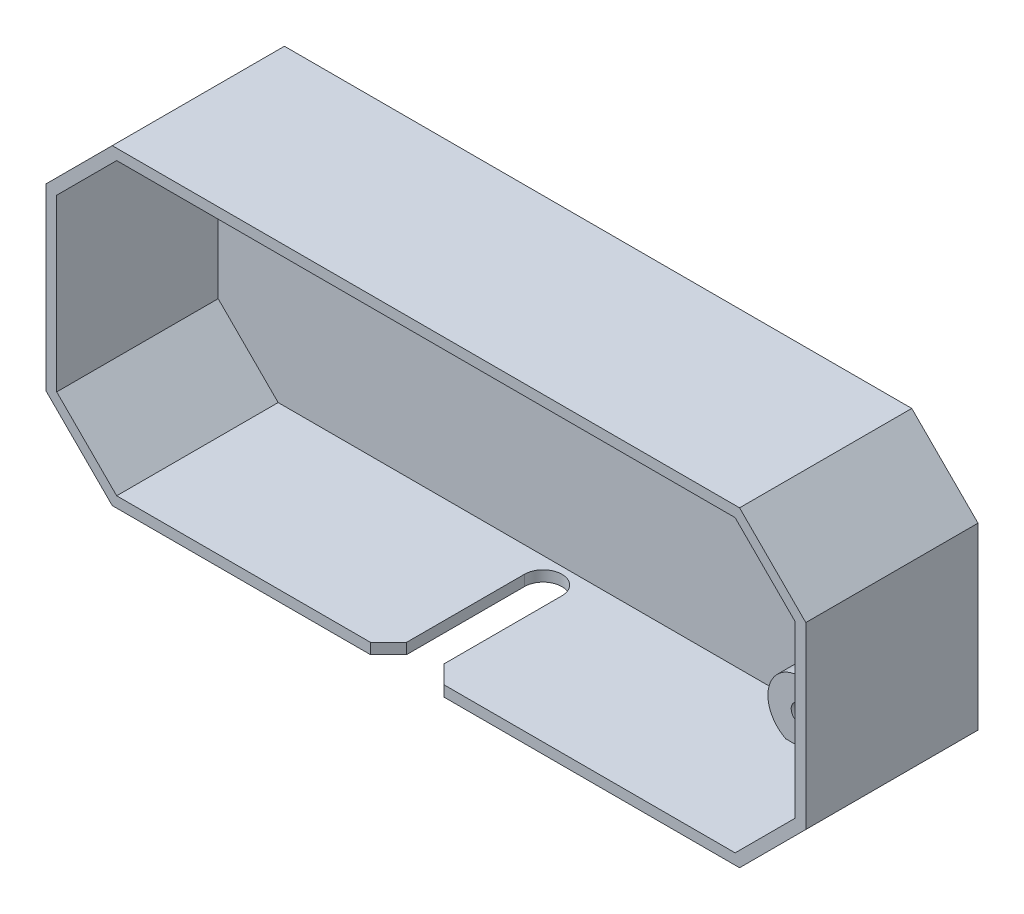
ISO-10303-21;
HEADER;
FILE_DESCRIPTION(('STEP AP214'),'2;1');
FILE_NAME('part.step','',(''),(''),'','','');
FILE_SCHEMA(('AUTOMOTIVE_DESIGN { 1 0 10303 214 1 1 1 1 }'));
ENDSEC;
DATA;
#1=APPLICATION_CONTEXT('core data for automotive mechanical design processes');
#2=APPLICATION_PROTOCOL_DEFINITION('international standard','automotive_design',2000,#1);
#3=PRODUCT_CONTEXT('',#1,'mechanical');
#4=PRODUCT('Part','Part','',(#3));
#5=PRODUCT_RELATED_PRODUCT_CATEGORY('part','',(#4));
#6=PRODUCT_DEFINITION_FORMATION('','',#4);
#7=PRODUCT_DEFINITION_CONTEXT('part definition',#1,'design');
#8=PRODUCT_DEFINITION('design','',#6,#7);
#9=PRODUCT_DEFINITION_SHAPE('','',#8);
#10=(LENGTH_UNIT() NAMED_UNIT(*) SI_UNIT(.MILLI.,.METRE.));
#11=(NAMED_UNIT(*) PLANE_ANGLE_UNIT() SI_UNIT($,.RADIAN.));
#12=(NAMED_UNIT(*) SI_UNIT($,.STERADIAN.) SOLID_ANGLE_UNIT());
#13=UNCERTAINTY_MEASURE_WITH_UNIT(LENGTH_MEASURE(1.E-05),#10,'distance_accuracy_value','');
#14=(GEOMETRIC_REPRESENTATION_CONTEXT(3) GLOBAL_UNCERTAINTY_ASSIGNED_CONTEXT((#13)) GLOBAL_UNIT_ASSIGNED_CONTEXT((#10,
#11,#12)) REPRESENTATION_CONTEXT('',''));
#15=CARTESIAN_POINT('',(0.,0.,0.));
#16=DIRECTION('',(0.,0.,1.));
#17=DIRECTION('',(1.,0.,0.));
#18=AXIS2_PLACEMENT_3D('',#15,#16,#17);
#19=CARTESIAN_POINT('',(0.,0.,0.8));
#20=DIRECTION('',(0.,0.,-1.));
#21=DIRECTION('',(-1.,0.,0.));
#22=AXIS2_PLACEMENT_3D('',#19,#20,#21);
#23=PLANE('',#22);
#24=CARTESIAN_POINT('',(18.694400051,-8.686800051,0.8));
#25=DIRECTION('',(0.,0.,1.));
#26=DIRECTION('',(1.,0.,0.));
#27=AXIS2_PLACEMENT_3D('',#24,#25,#26);
#28=CIRCLE('',#27,2.413);
#29=CARTESIAN_POINT('',(19.7720307855283,-10.845800051,0.8));
#30=VERTEX_POINT('',#29);
#31=CARTESIAN_POINT('',(17.6167693164717,-10.845800051,0.8));
#32=VERTEX_POINT('',#31);
#33=EDGE_CURVE('E285',#30,#32,#28,.T.);
#34=ORIENTED_EDGE('',*,*,#33,.F.);
#35=DIRECTION('',(1.,0.,0.));
#36=VECTOR('',#35,1.);
#37=CARTESIAN_POINT('',(-23.1032817327957,-10.845800051,0.8));
#38=LINE('',#37,#36);
#39=CARTESIAN_POINT('',(23.1032817327957,-10.845800051,0.8));
#40=VERTEX_POINT('',#39);
#41=EDGE_CURVE('E342',#30,#40,#38,.T.);
#42=ORIENTED_EDGE('',*,*,#41,.T.);
#43=DIRECTION('',(0.707106781186544,0.707106781186551,0.));
#44=VECTOR('',#43,1.);
#45=CARTESIAN_POINT('',(23.1032817327957,-10.845800051,0.8));
#46=LINE('',#45,#44);
#47=CARTESIAN_POINT('',(27.584400051,-6.36468173279567,0.8));
#48=VERTEX_POINT('',#47);
#49=EDGE_CURVE('E346',#40,#48,#46,.T.);
#50=ORIENTED_EDGE('',*,*,#49,.T.);
#51=DIRECTION('',(0.,1.,0.));
#52=VECTOR('',#51,1.);
#53=CARTESIAN_POINT('',(27.584400051,-6.36468173279567,0.8));
#54=LINE('',#53,#52);
#55=CARTESIAN_POINT('',(27.584400051,6.36468173279571,0.8));
#56=VERTEX_POINT('',#55);
#57=EDGE_CURVE('E349',#48,#56,#54,.T.);
#58=ORIENTED_EDGE('',*,*,#57,.T.);
#59=DIRECTION('',(-0.707106781186551,0.707106781186544,0.));
#60=VECTOR('',#59,1.);
#61=CARTESIAN_POINT('',(27.584400051,6.36468173279571,0.8));
#62=LINE('',#61,#60);
#63=CARTESIAN_POINT('',(23.1032817327957,10.845800051,0.8));
#64=VERTEX_POINT('',#63);
#65=EDGE_CURVE('E312',#56,#64,#62,.T.);
#66=ORIENTED_EDGE('',*,*,#65,.T.);
#67=DIRECTION('',(-1.,0.,0.));
#68=VECTOR('',#67,1.);
#69=CARTESIAN_POINT('',(23.1032817327957,10.845800051,0.8));
#70=LINE('',#69,#68);
#71=CARTESIAN_POINT('',(-20.4410373037231,10.845800051,0.8));
#72=VERTEX_POINT('',#71);
#73=EDGE_CURVE('E330',#64,#72,#70,.T.);
#74=ORIENTED_EDGE('',*,*,#73,.T.);
#75=CARTESIAN_POINT('',(-21.742400051,8.813800051,0.8));
#76=DIRECTION('',(0.,0.,-1.));
#77=DIRECTION('',(-1.,0.,0.));
#78=AXIS2_PLACEMENT_3D('',#75,#76,#77);
#79=CIRCLE('',#78,2.413);
#80=CARTESIAN_POINT('',(-23.6215236040898,10.3275581797058,0.8));
#81=VERTEX_POINT('',#80);
#82=EDGE_CURVE('E437',#81,#72,#79,.F.);
#83=ORIENTED_EDGE('',*,*,#82,.F.);
#84=DIRECTION('',(-0.707106781186551,-0.707106781186544,0.));
#85=VECTOR('',#84,1.);
#86=CARTESIAN_POINT('',(-23.1032817327957,10.845800051,0.8));
#87=LINE('',#86,#85);
#88=CARTESIAN_POINT('',(-27.584400051,6.36468173279571,0.8));
#89=VERTEX_POINT('',#88);
#90=EDGE_CURVE('E332',#81,#89,#87,.T.);
#91=ORIENTED_EDGE('',*,*,#90,.T.);
#92=DIRECTION('',(0.,-1.,0.));
#93=VECTOR('',#92,1.);
#94=CARTESIAN_POINT('',(-27.584400051,6.36468173279571,0.8));
#95=LINE('',#94,#93);
#96=CARTESIAN_POINT('',(-27.584400051,-6.36468173279567,0.8));
#97=VERTEX_POINT('',#96);
#98=EDGE_CURVE('E336',#89,#97,#95,.T.);
#99=ORIENTED_EDGE('',*,*,#98,.T.);
#100=DIRECTION('',(0.707106781186544,-0.707106781186551,0.));
#101=VECTOR('',#100,1.);
#102=CARTESIAN_POINT('',(-27.584400051,-6.36468173279567,0.8));
#103=LINE('',#102,#101);
#104=CARTESIAN_POINT('',(-23.1032817327957,-10.845800051,0.8));
#105=VERTEX_POINT('',#104);
#106=EDGE_CURVE('E339',#97,#105,#103,.T.);
#107=ORIENTED_EDGE('',*,*,#106,.T.);
#108=EDGE_CURVE('E343',#105,#32,#38,.T.);
#109=ORIENTED_EDGE('',*,*,#108,.T.);
#110=EDGE_LOOP('',(#34,#42,#50,#58,#66,#74,#83,#91,#99,#107,#109));
#111=FACE_BOUND('',#110,.T.);
#112=ADVANCED_FACE('F41',(#111),#23,.F.);
#113=CARTESIAN_POINT('',(-23.1032817327957,-10.845800051,12.865));
#114=DIRECTION('',(0.,1.,0.));
#115=DIRECTION('',(0.,0.,1.));
#116=AXIS2_PLACEMENT_3D('',#113,#114,#115);
#117=PLANE('',#116);
#118=DIRECTION('',(-0.707106781186551,0.,0.707106781186544));
#119=VECTOR('',#118,1.);
#120=CARTESIAN_POINT('',(-13.6221600754781,-10.845800051,22.3461216573177));
#121=LINE('',#120,#119);
#122=CARTESIAN_POINT('',(-2.794,-10.845800051,11.5179615818396));
#123=VERTEX_POINT('',#122);
#124=CARTESIAN_POINT('',(-4.14103841816038,-10.845800051,12.865));
#125=VERTEX_POINT('',#124);
#126=EDGE_CURVE('E266',#123,#125,#121,.T.);
#127=ORIENTED_EDGE('',*,*,#126,.F.);
#128=DIRECTION('',(0.,0.,1.));
#129=VECTOR('',#128,1.);
#130=CARTESIAN_POINT('',(-2.79400000000001,-10.845800051,12.8650000000001));
#131=LINE('',#130,#129);
#132=CARTESIAN_POINT('',(-2.79399999999994,-10.845800051,2.705));
#133=VERTEX_POINT('',#132);
#134=EDGE_CURVE('E269',#133,#123,#131,.T.);
#135=ORIENTED_EDGE('',*,*,#134,.F.);
#136=CARTESIAN_POINT('',(-1.39699999999994,-10.845800051,2.705));
#137=DIRECTION('',(0.,1.,0.));
#138=DIRECTION('',(0.,0.,1.));
#139=AXIS2_PLACEMENT_3D('',#136,#137,#138);
#140=CIRCLE('',#139,1.397);
#141=CARTESIAN_POINT('',(0.,-10.845800051,2.705));
#142=VERTEX_POINT('',#141);
#143=EDGE_CURVE('E271',#142,#133,#140,.T.);
#144=ORIENTED_EDGE('',*,*,#143,.F.);
#145=DIRECTION('',(0.,0.,-1.));
#146=VECTOR('',#145,1.);
#147=CARTESIAN_POINT('',(1.28369537222284E-13,-10.845800051,12.8649999999998));
#148=LINE('',#147,#146);
#149=CARTESIAN_POINT('',(1.19465925829897E-13,-10.845800051,11.5179615818395));
#150=VERTEX_POINT('',#149);
#151=EDGE_CURVE('E234',#150,#142,#148,.T.);
#152=ORIENTED_EDGE('',*,*,#151,.F.);
#153=DIRECTION('',(-0.707106781186489,0.,-0.707106781186606));
#154=VECTOR('',#153,1.);
#155=CARTESIAN_POINT('',(-10.8781216573156,-10.845800051,0.639839924521955));
#156=LINE('',#155,#154);
#157=CARTESIAN_POINT('',(1.34703841816038,-10.845800051,12.865));
#158=VERTEX_POINT('',#157);
#159=EDGE_CURVE('E260',#158,#150,#156,.T.);
#160=ORIENTED_EDGE('',*,*,#159,.F.);
#161=DIRECTION('',(1.,0.,0.));
#162=VECTOR('',#161,1.);
#163=CARTESIAN_POINT('',(-23.1032817327957,-10.845800051,12.865));
#164=LINE('',#163,#162);
#165=CARTESIAN_POINT('',(23.1032817327957,-10.845800051,12.865));
#166=VERTEX_POINT('',#165);
#167=EDGE_CURVE('E318',#158,#166,#164,.T.);
#168=ORIENTED_EDGE('',*,*,#167,.T.);
#169=DIRECTION('',(0.,0.,-1.));
#170=VECTOR('',#169,1.);
#171=CARTESIAN_POINT('',(23.1032817327957,-10.845800051,12.865));
#172=LINE('',#171,#170);
#173=EDGE_CURVE('E359',#166,#40,#172,.T.);
#174=ORIENTED_EDGE('',*,*,#173,.T.);
#175=ORIENTED_EDGE('',*,*,#41,.F.);
#176=DIRECTION('',(0.,0.,-1.));
#177=VECTOR('',#176,1.);
#178=CARTESIAN_POINT('',(19.7720307855283,-10.845800051,3.594));
#179=LINE('',#178,#177);
#180=CARTESIAN_POINT('',(19.7720307855283,-10.845800051,3.594));
#181=VERTEX_POINT('',#180);
#182=EDGE_CURVE('E447',#30,#181,#179,.F.);
#183=ORIENTED_EDGE('',*,*,#182,.T.);
#184=DIRECTION('',(1.,0.,0.));
#185=VECTOR('',#184,1.);
#186=CARTESIAN_POINT('',(-23.1032817327957,-10.845800051,3.594));
#187=LINE('',#186,#185);
#188=CARTESIAN_POINT('',(17.6167693164717,-10.845800051,3.594));
#189=VERTEX_POINT('',#188);
#190=EDGE_CURVE('E66',#189,#181,#187,.T.);
#191=ORIENTED_EDGE('',*,*,#190,.F.);
#192=DIRECTION('',(0.,0.,-1.));
#193=VECTOR('',#192,1.);
#194=CARTESIAN_POINT('',(17.6167693164717,-10.845800051,3.594));
#195=LINE('',#194,#193);
#196=EDGE_CURVE('E445',#189,#32,#195,.T.);
#197=ORIENTED_EDGE('',*,*,#196,.T.);
#198=ORIENTED_EDGE('',*,*,#108,.F.);
#199=DIRECTION('',(0.,0.,-1.));
#200=VECTOR('',#199,1.);
#201=CARTESIAN_POINT('',(-23.1032817327957,-10.845800051,12.865));
#202=LINE('',#201,#200);
#203=CARTESIAN_POINT('',(-23.1032817327957,-10.845800051,12.865));
#204=VERTEX_POINT('',#203);
#205=EDGE_CURVE('E362',#204,#105,#202,.T.);
#206=ORIENTED_EDGE('',*,*,#205,.F.);
#207=EDGE_CURVE('E319',#204,#125,#164,.T.);
#208=ORIENTED_EDGE('',*,*,#207,.T.);
#209=EDGE_LOOP('',(#127,#135,#144,#152,#160,#168,#174,#175,#183,#191,#197,#198,#206,#208));
#210=FACE_BOUND('',#209,.T.);
#211=ADVANCED_FACE('F455',(#210),#117,.T.);
#212=CARTESIAN_POINT('',(23.1032817327957,10.845800051,12.865));
#213=DIRECTION('',(0.,-1.,0.));
#214=DIRECTION('',(0.,0.,-1.));
#215=AXIS2_PLACEMENT_3D('',#212,#213,#214);
#216=PLANE('',#215);
#217=CARTESIAN_POINT('',(-23.0437627982769,10.845800051,0.8));
#218=VERTEX_POINT('',#217);
#219=CARTESIAN_POINT('',(-23.1032817327957,10.845800051,0.8));
#220=VERTEX_POINT('',#219);
#221=EDGE_CURVE('E307',#218,#220,#70,.T.);
#222=ORIENTED_EDGE('',*,*,#221,.F.);
#223=DIRECTION('',(0.,0.,-1.));
#224=VECTOR('',#223,1.);
#225=CARTESIAN_POINT('',(-23.0437627982769,10.845800051,3.594));
#226=LINE('',#225,#224);
#227=CARTESIAN_POINT('',(-23.0437627982769,10.845800051,3.594));
#228=VERTEX_POINT('',#227);
#229=EDGE_CURVE('E302',#218,#228,#226,.F.);
#230=ORIENTED_EDGE('',*,*,#229,.T.);
#231=DIRECTION('',(-1.,0.,0.));
#232=VECTOR('',#231,1.);
#233=CARTESIAN_POINT('',(23.1032817327957,10.845800051,3.594));
#234=LINE('',#233,#232);
#235=CARTESIAN_POINT('',(-20.4410373037231,10.845800051,3.594));
#236=VERTEX_POINT('',#235);
#237=EDGE_CURVE('E304',#236,#228,#234,.T.);
#238=ORIENTED_EDGE('',*,*,#237,.F.);
#239=DIRECTION('',(0.,0.,-1.));
#240=VECTOR('',#239,1.);
#241=CARTESIAN_POINT('',(-20.4410373037231,10.845800051,3.594));
#242=LINE('',#241,#240);
#243=EDGE_CURVE('E299',#236,#72,#242,.T.);
#244=ORIENTED_EDGE('',*,*,#243,.T.);
#245=ORIENTED_EDGE('',*,*,#73,.F.);
#246=DIRECTION('',(0.,0.,-1.));
#247=VECTOR('',#246,1.);
#248=CARTESIAN_POINT('',(23.1032817327957,10.845800051,12.865));
#249=LINE('',#248,#247);
#250=CARTESIAN_POINT('',(23.1032817327957,10.845800051,12.865));
#251=VERTEX_POINT('',#250);
#252=EDGE_CURVE('E329',#251,#64,#249,.T.);
#253=ORIENTED_EDGE('',*,*,#252,.F.);
#254=DIRECTION('',(-1.,0.,0.));
#255=VECTOR('',#254,1.);
#256=CARTESIAN_POINT('',(23.1032817327957,10.845800051,12.865));
#257=LINE('',#256,#255);
#258=CARTESIAN_POINT('',(-23.1032817327957,10.845800051,12.865));
#259=VERTEX_POINT('',#258);
#260=EDGE_CURVE('E308',#251,#259,#257,.T.);
#261=ORIENTED_EDGE('',*,*,#260,.T.);
#262=DIRECTION('',(0.,0.,-1.));
#263=VECTOR('',#262,1.);
#264=CARTESIAN_POINT('',(-23.1032817327957,10.845800051,12.865));
#265=LINE('',#264,#263);
#266=EDGE_CURVE('E369',#259,#220,#265,.T.);
#267=ORIENTED_EDGE('',*,*,#266,.T.);
#268=EDGE_LOOP('',(#222,#230,#238,#244,#245,#253,#261,#267));
#269=FACE_BOUND('',#268,.T.);
#270=ADVANCED_FACE('F499',(#269),#216,.T.);
#271=CARTESIAN_POINT('',(-23.1032817327957,10.845800051,12.865));
#272=DIRECTION('',(0.707106781186544,-0.707106781186551,0.));
#273=DIRECTION('',(0.707106781186551,0.707106781186544,0.));
#274=AXIS2_PLACEMENT_3D('',#271,#272,#273);
#275=PLANE('',#274);
#276=ORIENTED_EDGE('',*,*,#90,.F.);
#277=DIRECTION('',(0.,0.,-1.));
#278=VECTOR('',#277,1.);
#279=CARTESIAN_POINT('',(-23.6215236040898,10.3275581797058,3.594));
#280=LINE('',#279,#278);
#281=CARTESIAN_POINT('',(-23.6215236040898,10.3275581797058,3.594));
#282=VERTEX_POINT('',#281);
#283=EDGE_CURVE('E297',#81,#282,#280,.F.);
#284=ORIENTED_EDGE('',*,*,#283,.T.);
#285=DIRECTION('',(-0.707106781186551,-0.707106781186544,0.));
#286=VECTOR('',#285,1.);
#287=CARTESIAN_POINT('',(-23.1032817327957,10.845800051,3.594));
#288=LINE('',#287,#286);
#289=CARTESIAN_POINT('',(-23.2561581797058,10.6929236040899,3.594));
#290=VERTEX_POINT('',#289);
#291=EDGE_CURVE('E441',#290,#282,#288,.T.);
#292=ORIENTED_EDGE('',*,*,#291,.F.);
#293=DIRECTION('',(0.,0.,-1.));
#294=VECTOR('',#293,1.);
#295=CARTESIAN_POINT('',(-23.2561581797058,10.6929236040899,3.594));
#296=LINE('',#295,#294);
#297=CARTESIAN_POINT('',(-23.2561581797058,10.6929236040899,0.8));
#298=VERTEX_POINT('',#297);
#299=EDGE_CURVE('E295',#290,#298,#296,.T.);
#300=ORIENTED_EDGE('',*,*,#299,.T.);
#301=EDGE_CURVE('E333',#220,#298,#87,.T.);
#302=ORIENTED_EDGE('',*,*,#301,.F.);
#303=ORIENTED_EDGE('',*,*,#266,.F.);
#304=DIRECTION('',(-0.707106781186551,-0.707106781186544,0.));
#305=VECTOR('',#304,1.);
#306=CARTESIAN_POINT('',(-23.1032817327957,10.845800051,12.865));
#307=LINE('',#306,#305);
#308=CARTESIAN_POINT('',(-27.584400051,6.36468173279571,12.865));
#309=VERTEX_POINT('',#308);
#310=EDGE_CURVE('E311',#259,#309,#307,.T.);
#311=ORIENTED_EDGE('',*,*,#310,.T.);
#312=DIRECTION('',(0.,0.,-1.));
#313=VECTOR('',#312,1.);
#314=CARTESIAN_POINT('',(-27.584400051,6.36468173279571,12.865));
#315=LINE('',#314,#313);
#316=EDGE_CURVE('E366',#309,#89,#315,.T.);
#317=ORIENTED_EDGE('',*,*,#316,.T.);
#318=EDGE_LOOP('',(#276,#284,#292,#300,#302,#303,#311,#317));
#319=FACE_BOUND('',#318,.T.);
#320=ADVANCED_FACE('F504',(#319),#275,.T.);
#321=EDGE_CURVE('E440',#218,#298,#79,.F.);
#322=ORIENTED_EDGE('',*,*,#321,.F.);
#323=ORIENTED_EDGE('',*,*,#221,.T.);
#324=ORIENTED_EDGE('',*,*,#301,.T.);
#325=EDGE_LOOP('',(#322,#323,#324));
#326=FACE_BOUND('',#325,.T.);
#327=ADVANCED_FACE('F495',(#326),#23,.F.);
#328=CARTESIAN_POINT('',(28.384400051,-11.645800051,0.8));
#329=DIRECTION('',(-1.,0.,0.));
#330=DIRECTION('',(0.,0.,1.));
#331=AXIS2_PLACEMENT_3D('',#328,#329,#330);
#332=PLANE('',#331);
#333=DIRECTION('',(0.,1.,0.));
#334=VECTOR('',#333,1.);
#335=CARTESIAN_POINT('',(28.384400051,-11.645800051,0.));
#336=LINE('',#335,#334);
#337=CARTESIAN_POINT('',(28.384400051,-6.69605258269414,0.));
#338=VERTEX_POINT('',#337);
#339=CARTESIAN_POINT('',(28.384400051,6.69605258269418,0.));
#340=VERTEX_POINT('',#339);
#341=EDGE_CURVE('E426',#338,#340,#336,.T.);
#342=ORIENTED_EDGE('',*,*,#341,.T.);
#343=DIRECTION('',(0.,0.,1.));
#344=VECTOR('',#343,1.);
#345=CARTESIAN_POINT('',(28.384400051,6.69605258269419,0.));
#346=LINE('',#345,#344);
#347=CARTESIAN_POINT('',(28.384400051,6.69605258269419,12.865));
#348=VERTEX_POINT('',#347);
#349=EDGE_CURVE('E402',#340,#348,#346,.T.);
#350=ORIENTED_EDGE('',*,*,#349,.T.);
#351=DIRECTION('',(0.,1.,0.));
#352=VECTOR('',#351,1.);
#353=CARTESIAN_POINT('',(28.384400051,-6.69605258269414,12.865));
#354=LINE('',#353,#352);
#355=CARTESIAN_POINT('',(28.384400051,-6.69605258269414,12.865));
#356=VERTEX_POINT('',#355);
#357=EDGE_CURVE('E395',#356,#348,#354,.T.);
#358=ORIENTED_EDGE('',*,*,#357,.F.);
#359=DIRECTION('',(0.,0.,1.));
#360=VECTOR('',#359,1.);
#361=CARTESIAN_POINT('',(28.384400051,-6.69605258269414,0.));
#362=LINE('',#361,#360);
#363=EDGE_CURVE('E408',#338,#356,#362,.T.);
#364=ORIENTED_EDGE('',*,*,#363,.F.);
#365=EDGE_LOOP('',(#342,#350,#358,#364));
#366=FACE_BOUND('',#365,.T.);
#367=ADVANCED_FACE('F43',(#366),#332,.F.);
#368=CARTESIAN_POINT('',(-28.384400051,11.645800051,0.8));
#369=DIRECTION('',(0.,-1.,0.));
#370=DIRECTION('',(0.,0.,-1.));
#371=AXIS2_PLACEMENT_3D('',#368,#369,#370);
#372=PLANE('',#371);
#373=DIRECTION('',(0.,0.,1.));
#374=VECTOR('',#373,1.);
#375=CARTESIAN_POINT('',(-23.4346525826941,11.645800051,0.));
#376=LINE('',#375,#374);
#377=CARTESIAN_POINT('',(-23.4346525826941,11.645800051,0.));
#378=VERTEX_POINT('',#377);
#379=CARTESIAN_POINT('',(-23.4346525826941,11.645800051,12.865));
#380=VERTEX_POINT('',#379);
#381=EDGE_CURVE('E417',#378,#380,#376,.T.);
#382=ORIENTED_EDGE('',*,*,#381,.T.);
#383=DIRECTION('',(-1.,0.,0.));
#384=VECTOR('',#383,1.);
#385=CARTESIAN_POINT('',(23.4346525826941,11.645800051,12.865));
#386=LINE('',#385,#384);
#387=CARTESIAN_POINT('',(23.4346525826941,11.645800051,12.865));
#388=VERTEX_POINT('',#387);
#389=EDGE_CURVE('E375',#388,#380,#386,.T.);
#390=ORIENTED_EDGE('',*,*,#389,.F.);
#391=DIRECTION('',(0.,0.,1.));
#392=VECTOR('',#391,1.);
#393=CARTESIAN_POINT('',(23.4346525826941,11.645800051,0.));
#394=LINE('',#393,#392);
#395=CARTESIAN_POINT('',(23.4346525826941,11.645800051,0.));
#396=VERTEX_POINT('',#395);
#397=EDGE_CURVE('E401',#396,#388,#394,.T.);
#398=ORIENTED_EDGE('',*,*,#397,.F.);
#399=DIRECTION('',(-1.,0.,0.));
#400=VECTOR('',#399,1.);
#401=CARTESIAN_POINT('',(-28.384400051,11.645800051,0.));
#402=LINE('',#401,#400);
#403=EDGE_CURVE('E430',#396,#378,#402,.T.);
#404=ORIENTED_EDGE('',*,*,#403,.T.);
#405=EDGE_LOOP('',(#382,#390,#398,#404));
#406=FACE_BOUND('',#405,.T.);
#407=ADVANCED_FACE('F510',(#406),#372,.F.);
#408=CARTESIAN_POINT('',(-28.384400051,-11.645800051,0.8));
#409=DIRECTION('',(1.,0.,0.));
#410=DIRECTION('',(0.,0.,-1.));
#411=AXIS2_PLACEMENT_3D('',#408,#409,#410);
#412=PLANE('',#411);
#413=DIRECTION('',(0.,0.,1.));
#414=VECTOR('',#413,1.);
#415=CARTESIAN_POINT('',(-28.384400051,-6.69605258269414,0.));
#416=LINE('',#415,#414);
#417=CARTESIAN_POINT('',(-28.384400051,-6.69605258269414,0.));
#418=VERTEX_POINT('',#417);
#419=CARTESIAN_POINT('',(-28.384400051,-6.69605258269415,12.865));
#420=VERTEX_POINT('',#419);
#421=EDGE_CURVE('E424',#418,#420,#416,.T.);
#422=ORIENTED_EDGE('',*,*,#421,.T.);
#423=DIRECTION('',(0.,-1.,0.));
#424=VECTOR('',#423,1.);
#425=CARTESIAN_POINT('',(-28.384400051,6.69605258269419,12.865));
#426=LINE('',#425,#424);
#427=CARTESIAN_POINT('',(-28.384400051,6.69605258269419,12.865));
#428=VERTEX_POINT('',#427);
#429=EDGE_CURVE('E382',#428,#420,#426,.T.);
#430=ORIENTED_EDGE('',*,*,#429,.F.);
#431=DIRECTION('',(0.,0.,1.));
#432=VECTOR('',#431,1.);
#433=CARTESIAN_POINT('',(-28.384400051,6.69605258269419,0.));
#434=LINE('',#433,#432);
#435=CARTESIAN_POINT('',(-28.384400051,6.69605258269419,0.));
#436=VERTEX_POINT('',#435);
#437=EDGE_CURVE('E416',#436,#428,#434,.T.);
#438=ORIENTED_EDGE('',*,*,#437,.F.);
#439=DIRECTION('',(0.,-1.,0.));
#440=VECTOR('',#439,1.);
#441=CARTESIAN_POINT('',(-28.384400051,-11.645800051,0.));
#442=LINE('',#441,#440);
#443=EDGE_CURVE('E432',#436,#418,#442,.T.);
#444=ORIENTED_EDGE('',*,*,#443,.T.);
#445=EDGE_LOOP('',(#422,#430,#438,#444));
#446=FACE_BOUND('',#445,.T.);
#447=ADVANCED_FACE('F634',(#446),#412,.F.);
#448=CARTESIAN_POINT('',(-28.384400051,-11.645800051,0.8));
#449=DIRECTION('',(0.,1.,0.));
#450=DIRECTION('',(0.,0.,1.));
#451=AXIS2_PLACEMENT_3D('',#448,#449,#450);
#452=PLANE('',#451);
#453=DIRECTION('',(0.,0.,-1.));
#454=VECTOR('',#453,1.);
#455=CARTESIAN_POINT('',(-2.79399999999994,-11.645800051,2.705));
#456=LINE('',#455,#454);
#457=CARTESIAN_POINT('',(-2.794,-11.645800051,11.5179615818396));
#458=VERTEX_POINT('',#457);
#459=CARTESIAN_POINT('',(-2.79399999999994,-11.645800051,2.705));
#460=VERTEX_POINT('',#459);
#461=EDGE_CURVE('E238',#458,#460,#456,.T.);
#462=ORIENTED_EDGE('',*,*,#461,.F.);
#463=DIRECTION('',(0.707106781186551,0.,-0.707106781186544));
#464=VECTOR('',#463,1.);
#465=CARTESIAN_POINT('',(-2.794,-11.645800051,11.5179615818396));
#466=LINE('',#465,#464);
#467=CARTESIAN_POINT('',(-4.14103841816038,-11.645800051,12.865));
#468=VERTEX_POINT('',#467);
#469=EDGE_CURVE('E253',#468,#458,#466,.T.);
#470=ORIENTED_EDGE('',*,*,#469,.F.);
#471=DIRECTION('',(1.,0.,0.));
#472=VECTOR('',#471,1.);
#473=CARTESIAN_POINT('',(-23.4346525826942,-11.645800051,12.865));
#474=LINE('',#473,#472);
#475=CARTESIAN_POINT('',(-23.4346525826942,-11.645800051,12.865));
#476=VERTEX_POINT('',#475);
#477=EDGE_CURVE('E389',#476,#468,#474,.T.);
#478=ORIENTED_EDGE('',*,*,#477,.F.);
#479=DIRECTION('',(0.,0.,1.));
#480=VECTOR('',#479,1.);
#481=CARTESIAN_POINT('',(-23.4346525826942,-11.645800051,0.));
#482=LINE('',#481,#480);
#483=CARTESIAN_POINT('',(-23.4346525826942,-11.645800051,0.));
#484=VERTEX_POINT('',#483);
#485=EDGE_CURVE('E423',#484,#476,#482,.T.);
#486=ORIENTED_EDGE('',*,*,#485,.F.);
#487=DIRECTION('',(1.,0.,0.));
#488=VECTOR('',#487,1.);
#489=CARTESIAN_POINT('',(-28.384400051,-11.645800051,0.));
#490=LINE('',#489,#488);
#491=CARTESIAN_POINT('',(23.4346525826942,-11.645800051,0.));
#492=VERTEX_POINT('',#491);
#493=EDGE_CURVE('E434',#484,#492,#490,.T.);
#494=ORIENTED_EDGE('',*,*,#493,.T.);
#495=DIRECTION('',(0.,0.,1.));
#496=VECTOR('',#495,1.);
#497=CARTESIAN_POINT('',(23.4346525826942,-11.645800051,0.));
#498=LINE('',#497,#496);
#499=CARTESIAN_POINT('',(23.4346525826942,-11.645800051,12.865));
#500=VERTEX_POINT('',#499);
#501=EDGE_CURVE('E409',#492,#500,#498,.T.);
#502=ORIENTED_EDGE('',*,*,#501,.T.);
#503=CARTESIAN_POINT('',(1.34703841816038,-11.645800051,12.865));
#504=VERTEX_POINT('',#503);
#505=EDGE_CURVE('E388',#504,#500,#474,.T.);
#506=ORIENTED_EDGE('',*,*,#505,.F.);
#507=DIRECTION('',(0.707106781186489,0.,0.707106781186606));
#508=VECTOR('',#507,1.);
#509=CARTESIAN_POINT('',(1.19465925829897E-13,-11.645800051,11.5179615818395));
#510=LINE('',#509,#508);
#511=CARTESIAN_POINT('',(1.19465925829897E-13,-11.645800051,11.5179615818395));
#512=VERTEX_POINT('',#511);
#513=EDGE_CURVE('E58',#512,#504,#510,.T.);
#514=ORIENTED_EDGE('',*,*,#513,.F.);
#515=DIRECTION('',(0.,0.,1.));
#516=VECTOR('',#515,1.);
#517=CARTESIAN_POINT('',(1.19465925829897E-13,-11.645800051,11.5179615818395));
#518=LINE('',#517,#516);
#519=CARTESIAN_POINT('',(0.,-11.645800051,2.705));
#520=VERTEX_POINT('',#519);
#521=EDGE_CURVE('E232',#520,#512,#518,.T.);
#522=ORIENTED_EDGE('',*,*,#521,.F.);
#523=CARTESIAN_POINT('',(-1.39699999999994,-11.645800051,2.705));
#524=DIRECTION('',(0.,-1.,0.));
#525=DIRECTION('',(0.,0.,-1.));
#526=AXIS2_PLACEMENT_3D('',#523,#524,#525);
#527=CIRCLE('',#526,1.397);
#528=EDGE_CURVE('E241',#460,#520,#527,.T.);
#529=ORIENTED_EDGE('',*,*,#528,.F.);
#530=EDGE_LOOP('',(#462,#470,#478,#486,#494,#502,#506,#514,#522,#529));
#531=FACE_BOUND('',#530,.T.);
#532=ADVANCED_FACE('F249',(#531),#452,.F.);
#533=CARTESIAN_POINT('',(0.,0.,0.));
#534=DIRECTION('',(0.,0.,-1.));
#535=DIRECTION('',(-1.,0.,0.));
#536=AXIS2_PLACEMENT_3D('',#533,#534,#535);
#537=PLANE('',#536);
#538=DIRECTION('',(0.707106781186551,-0.707106781186544,0.));
#539=VECTOR('',#538,1.);
#540=CARTESIAN_POINT('',(23.4346525826941,11.645800051,0.));
#541=LINE('',#540,#539);
#542=EDGE_CURVE('E398',#396,#340,#541,.T.);
#543=ORIENTED_EDGE('',*,*,#542,.T.);
#544=ORIENTED_EDGE('',*,*,#341,.F.);
#545=DIRECTION('',(-0.707106781186544,-0.707106781186551,0.));
#546=VECTOR('',#545,1.);
#547=CARTESIAN_POINT('',(23.4346525826942,-11.645800051,0.));
#548=LINE('',#547,#546);
#549=EDGE_CURVE('E404',#338,#492,#548,.T.);
#550=ORIENTED_EDGE('',*,*,#549,.T.);
#551=ORIENTED_EDGE('',*,*,#493,.F.);
#552=DIRECTION('',(-0.707106781186544,0.707106781186551,0.));
#553=VECTOR('',#552,1.);
#554=CARTESIAN_POINT('',(-28.384400051,-6.69605258269414,0.));
#555=LINE('',#554,#553);
#556=EDGE_CURVE('E419',#484,#418,#555,.T.);
#557=ORIENTED_EDGE('',*,*,#556,.T.);
#558=ORIENTED_EDGE('',*,*,#443,.F.);
#559=DIRECTION('',(0.707106781186551,0.707106781186544,0.));
#560=VECTOR('',#559,1.);
#561=CARTESIAN_POINT('',(-28.384400051,6.69605258269419,0.));
#562=LINE('',#561,#560);
#563=EDGE_CURVE('E412',#436,#378,#562,.T.);
#564=ORIENTED_EDGE('',*,*,#563,.T.);
#565=ORIENTED_EDGE('',*,*,#403,.F.);
#566=EDGE_LOOP('',(#543,#544,#550,#551,#557,#558,#564,#565));
#567=FACE_BOUND('',#566,.T.);
#568=ADVANCED_FACE('F621',(#567),#537,.T.);
#569=CARTESIAN_POINT('',(-28.384400051,-6.69605258269414,0.));
#570=DIRECTION('',(0.707106781186551,0.707106781186544,0.));
#571=DIRECTION('',(-0.707106781186544,0.707106781186551,0.));
#572=AXIS2_PLACEMENT_3D('',#569,#570,#571);
#573=PLANE('',#572);
#574=ORIENTED_EDGE('',*,*,#485,.T.);
#575=DIRECTION('',(0.707106781186544,-0.707106781186551,0.));
#576=VECTOR('',#575,1.);
#577=CARTESIAN_POINT('',(-28.384400051,-6.69605258269415,12.865));
#578=LINE('',#577,#576);
#579=EDGE_CURVE('E385',#420,#476,#578,.T.);
#580=ORIENTED_EDGE('',*,*,#579,.F.);
#581=ORIENTED_EDGE('',*,*,#421,.F.);
#582=ORIENTED_EDGE('',*,*,#556,.F.);
#583=EDGE_LOOP('',(#574,#580,#581,#582));
#584=FACE_BOUND('',#583,.T.);
#585=ADVANCED_FACE('F618',(#584),#573,.F.);
#586=CARTESIAN_POINT('',(-28.384400051,6.69605258269419,0.));
#587=DIRECTION('',(0.707106781186544,-0.707106781186551,0.));
#588=DIRECTION('',(0.707106781186551,0.707106781186544,0.));
#589=AXIS2_PLACEMENT_3D('',#586,#587,#588);
#590=PLANE('',#589);
#591=ORIENTED_EDGE('',*,*,#437,.T.);
#592=DIRECTION('',(-0.707106781186551,-0.707106781186544,0.));
#593=VECTOR('',#592,1.);
#594=CARTESIAN_POINT('',(-23.4346525826941,11.645800051,12.865));
#595=LINE('',#594,#593);
#596=EDGE_CURVE('E379',#380,#428,#595,.T.);
#597=ORIENTED_EDGE('',*,*,#596,.F.);
#598=ORIENTED_EDGE('',*,*,#381,.F.);
#599=ORIENTED_EDGE('',*,*,#563,.F.);
#600=EDGE_LOOP('',(#591,#597,#598,#599));
#601=FACE_BOUND('',#600,.T.);
#602=ADVANCED_FACE('F615',(#601),#590,.F.);
#603=CARTESIAN_POINT('',(23.4346525826942,-11.645800051,0.));
#604=DIRECTION('',(-0.707106781186551,0.707106781186544,0.));
#605=DIRECTION('',(-0.707106781186544,-0.707106781186551,0.));
#606=AXIS2_PLACEMENT_3D('',#603,#604,#605);
#607=PLANE('',#606);
#608=ORIENTED_EDGE('',*,*,#363,.T.);
#609=DIRECTION('',(0.707106781186544,0.707106781186551,0.));
#610=VECTOR('',#609,1.);
#611=CARTESIAN_POINT('',(23.4346525826942,-11.645800051,12.865));
#612=LINE('',#611,#610);
#613=EDGE_CURVE('E392',#500,#356,#612,.T.);
#614=ORIENTED_EDGE('',*,*,#613,.F.);
#615=ORIENTED_EDGE('',*,*,#501,.F.);
#616=ORIENTED_EDGE('',*,*,#549,.F.);
#617=EDGE_LOOP('',(#608,#614,#615,#616));
#618=FACE_BOUND('',#617,.T.);
#619=ADVANCED_FACE('F611',(#618),#607,.F.);
#620=CARTESIAN_POINT('',(23.4346525826941,11.645800051,0.));
#621=DIRECTION('',(-0.707106781186544,-0.707106781186551,0.));
#622=DIRECTION('',(0.707106781186551,-0.707106781186544,0.));
#623=AXIS2_PLACEMENT_3D('',#620,#621,#622);
#624=PLANE('',#623);
#625=ORIENTED_EDGE('',*,*,#397,.T.);
#626=DIRECTION('',(-0.707106781186551,0.707106781186544,0.));
#627=VECTOR('',#626,1.);
#628=CARTESIAN_POINT('',(28.384400051,6.69605258269419,12.865));
#629=LINE('',#628,#627);
#630=EDGE_CURVE('E372',#348,#388,#629,.T.);
#631=ORIENTED_EDGE('',*,*,#630,.F.);
#632=ORIENTED_EDGE('',*,*,#349,.F.);
#633=ORIENTED_EDGE('',*,*,#542,.F.);
#634=EDGE_LOOP('',(#625,#631,#632,#633));
#635=FACE_BOUND('',#634,.T.);
#636=ADVANCED_FACE('F608',(#635),#624,.F.);
#637=CARTESIAN_POINT('',(0.,0.,12.865));
#638=DIRECTION('',(0.,0.,1.));
#639=DIRECTION('',(1.,0.,0.));
#640=AXIS2_PLACEMENT_3D('',#637,#638,#639);
#641=PLANE('',#640);
#642=DIRECTION('',(0.,-1.,0.));
#643=VECTOR('',#642,1.);
#644=CARTESIAN_POINT('',(-4.14103841816038,0.,12.865));
#645=LINE('',#644,#643);
#646=EDGE_CURVE('E11',#125,#468,#645,.T.);
#647=ORIENTED_EDGE('',*,*,#646,.F.);
#648=ORIENTED_EDGE('',*,*,#207,.F.);
#649=DIRECTION('',(0.707106781186544,-0.707106781186551,0.));
#650=VECTOR('',#649,1.);
#651=CARTESIAN_POINT('',(-27.584400051,-6.36468173279567,12.865));
#652=LINE('',#651,#650);
#653=CARTESIAN_POINT('',(-27.584400051,-6.36468173279567,12.865));
#654=VERTEX_POINT('',#653);
#655=EDGE_CURVE('E316',#654,#204,#652,.T.);
#656=ORIENTED_EDGE('',*,*,#655,.F.);
#657=DIRECTION('',(0.,-1.,0.));
#658=VECTOR('',#657,1.);
#659=CARTESIAN_POINT('',(-27.584400051,6.36468173279571,12.865));
#660=LINE('',#659,#658);
#661=EDGE_CURVE('E314',#309,#654,#660,.T.);
#662=ORIENTED_EDGE('',*,*,#661,.F.);
#663=ORIENTED_EDGE('',*,*,#310,.F.);
#664=ORIENTED_EDGE('',*,*,#260,.F.);
#665=DIRECTION('',(-0.707106781186551,0.707106781186544,0.));
#666=VECTOR('',#665,1.);
#667=CARTESIAN_POINT('',(27.584400051,6.36468173279571,12.865));
#668=LINE('',#667,#666);
#669=CARTESIAN_POINT('',(27.584400051,6.36468173279571,12.865));
#670=VERTEX_POINT('',#669);
#671=EDGE_CURVE('E327',#670,#251,#668,.T.);
#672=ORIENTED_EDGE('',*,*,#671,.F.);
#673=DIRECTION('',(0.,1.,0.));
#674=VECTOR('',#673,1.);
#675=CARTESIAN_POINT('',(27.584400051,-6.36468173279567,12.865));
#676=LINE('',#675,#674);
#677=CARTESIAN_POINT('',(27.584400051,-6.36468173279567,12.865));
#678=VERTEX_POINT('',#677);
#679=EDGE_CURVE('E324',#678,#670,#676,.T.);
#680=ORIENTED_EDGE('',*,*,#679,.F.);
#681=DIRECTION('',(0.707106781186544,0.707106781186551,0.));
#682=VECTOR('',#681,1.);
#683=CARTESIAN_POINT('',(23.1032817327957,-10.845800051,12.865));
#684=LINE('',#683,#682);
#685=EDGE_CURVE('E322',#166,#678,#684,.T.);
#686=ORIENTED_EDGE('',*,*,#685,.F.);
#687=ORIENTED_EDGE('',*,*,#167,.F.);
#688=DIRECTION('',(0.,1.,0.));
#689=VECTOR('',#688,1.);
#690=CARTESIAN_POINT('',(1.34703841816038,0.,12.865));
#691=LINE('',#690,#689);
#692=EDGE_CURVE('E49',#504,#158,#691,.T.);
#693=ORIENTED_EDGE('',*,*,#692,.F.);
#694=ORIENTED_EDGE('',*,*,#505,.T.);
#695=ORIENTED_EDGE('',*,*,#613,.T.);
#696=ORIENTED_EDGE('',*,*,#357,.T.);
#697=ORIENTED_EDGE('',*,*,#630,.T.);
#698=ORIENTED_EDGE('',*,*,#389,.T.);
#699=ORIENTED_EDGE('',*,*,#596,.T.);
#700=ORIENTED_EDGE('',*,*,#429,.T.);
#701=ORIENTED_EDGE('',*,*,#579,.T.);
#702=ORIENTED_EDGE('',*,*,#477,.T.);
#703=EDGE_LOOP('',(#647,#648,#656,#662,#663,#664,#672,#680,#686,#687,#693,#694,#695,#696,#697,
#698,#699,#700,#701,#702));
#704=FACE_BOUND('',#703,.T.);
#705=ADVANCED_FACE('F459',(#704),#641,.T.);
#706=CARTESIAN_POINT('',(-27.584400051,6.36468173279571,12.865));
#707=DIRECTION('',(1.,0.,0.));
#708=DIRECTION('',(0.,0.,-1.));
#709=AXIS2_PLACEMENT_3D('',#706,#707,#708);
#710=PLANE('',#709);
#711=ORIENTED_EDGE('',*,*,#98,.F.);
#712=ORIENTED_EDGE('',*,*,#316,.F.);
#713=ORIENTED_EDGE('',*,*,#661,.T.);
#714=DIRECTION('',(0.,0.,-1.));
#715=VECTOR('',#714,1.);
#716=CARTESIAN_POINT('',(-27.584400051,-6.36468173279567,12.865));
#717=LINE('',#716,#715);
#718=EDGE_CURVE('E364',#654,#97,#717,.T.);
#719=ORIENTED_EDGE('',*,*,#718,.T.);
#720=EDGE_LOOP('',(#711,#712,#713,#719));
#721=FACE_BOUND('',#720,.T.);
#722=ADVANCED_FACE('F538',(#721),#710,.T.);
#723=CARTESIAN_POINT('',(-27.584400051,-6.36468173279567,12.865));
#724=DIRECTION('',(0.707106781186551,0.707106781186544,0.));
#725=DIRECTION('',(-0.707106781186544,0.707106781186551,0.));
#726=AXIS2_PLACEMENT_3D('',#723,#724,#725);
#727=PLANE('',#726);
#728=ORIENTED_EDGE('',*,*,#106,.F.);
#729=ORIENTED_EDGE('',*,*,#718,.F.);
#730=ORIENTED_EDGE('',*,*,#655,.T.);
#731=ORIENTED_EDGE('',*,*,#205,.T.);
#732=EDGE_LOOP('',(#728,#729,#730,#731));
#733=FACE_BOUND('',#732,.T.);
#734=ADVANCED_FACE('F543',(#733),#727,.T.);
#735=CARTESIAN_POINT('',(23.1032817327957,-10.845800051,12.865));
#736=DIRECTION('',(-0.707106781186551,0.707106781186544,0.));
#737=DIRECTION('',(-0.707106781186544,-0.707106781186551,0.));
#738=AXIS2_PLACEMENT_3D('',#735,#736,#737);
#739=PLANE('',#738);
#740=ORIENTED_EDGE('',*,*,#49,.F.);
#741=ORIENTED_EDGE('',*,*,#173,.F.);
#742=ORIENTED_EDGE('',*,*,#685,.T.);
#743=DIRECTION('',(0.,0.,-1.));
#744=VECTOR('',#743,1.);
#745=CARTESIAN_POINT('',(27.584400051,-6.36468173279567,12.865));
#746=LINE('',#745,#744);
#747=EDGE_CURVE('E357',#678,#48,#746,.T.);
#748=ORIENTED_EDGE('',*,*,#747,.T.);
#749=EDGE_LOOP('',(#740,#741,#742,#748));
#750=FACE_BOUND('',#749,.T.);
#751=ADVANCED_FACE('F466',(#750),#739,.T.);
#752=CARTESIAN_POINT('',(27.584400051,-6.36468173279567,12.865));
#753=DIRECTION('',(-1.,0.,0.));
#754=DIRECTION('',(0.,-1.,0.));
#755=AXIS2_PLACEMENT_3D('',#752,#753,#754);
#756=PLANE('',#755);
#757=ORIENTED_EDGE('',*,*,#57,.F.);
#758=ORIENTED_EDGE('',*,*,#747,.F.);
#759=ORIENTED_EDGE('',*,*,#679,.T.);
#760=DIRECTION('',(0.,0.,-1.));
#761=VECTOR('',#760,1.);
#762=CARTESIAN_POINT('',(27.584400051,6.36468173279571,12.865));
#763=LINE('',#762,#761);
#764=EDGE_CURVE('E355',#670,#56,#763,.T.);
#765=ORIENTED_EDGE('',*,*,#764,.T.);
#766=EDGE_LOOP('',(#757,#758,#759,#765));
#767=FACE_BOUND('',#766,.T.);
#768=ADVANCED_FACE('F469',(#767),#756,.T.);
#769=CARTESIAN_POINT('',(27.584400051,6.36468173279571,12.865));
#770=DIRECTION('',(-0.707106781186544,-0.707106781186551,0.));
#771=DIRECTION('',(0.707106781186551,-0.707106781186544,0.));
#772=AXIS2_PLACEMENT_3D('',#769,#770,#771);
#773=PLANE('',#772);
#774=ORIENTED_EDGE('',*,*,#65,.F.);
#775=ORIENTED_EDGE('',*,*,#764,.F.);
#776=ORIENTED_EDGE('',*,*,#671,.T.);
#777=ORIENTED_EDGE('',*,*,#252,.T.);
#778=EDGE_LOOP('',(#774,#775,#776,#777));
#779=FACE_BOUND('',#778,.T.);
#780=ADVANCED_FACE('F592',(#779),#773,.T.);
#781=CARTESIAN_POINT('',(-21.742400051,8.813800051,3.594));
#782=DIRECTION('',(0.,0.,-1.));
#783=DIRECTION('',(-1.,0.,0.));
#784=AXIS2_PLACEMENT_3D('',#781,#782,#783);
#785=CYLINDRICAL_SURFACE('',#784,2.413);
#786=ORIENTED_EDGE('',*,*,#229,.F.);
#787=ORIENTED_EDGE('',*,*,#321,.T.);
#788=ORIENTED_EDGE('',*,*,#299,.F.);
#789=CARTESIAN_POINT('',(-21.742400051,8.813800051,3.594));
#790=DIRECTION('',(0.,0.,1.));
#791=DIRECTION('',(1.,0.,0.));
#792=AXIS2_PLACEMENT_3D('',#789,#790,#791);
#793=CIRCLE('',#792,2.413);
#794=EDGE_CURVE('E294',#228,#290,#793,.T.);
#795=ORIENTED_EDGE('',*,*,#794,.F.);
#796=EDGE_LOOP('',(#786,#787,#788,#795));
#797=FACE_BOUND('',#796,.T.);
#798=ADVANCED_FACE('F523',(#797),#785,.T.);
#799=ORIENTED_EDGE('',*,*,#243,.F.);
#800=EDGE_CURVE('E289',#282,#236,#793,.T.);
#801=ORIENTED_EDGE('',*,*,#800,.F.);
#802=ORIENTED_EDGE('',*,*,#283,.F.);
#803=ORIENTED_EDGE('',*,*,#82,.T.);
#804=EDGE_LOOP('',(#799,#801,#802,#803));
#805=FACE_BOUND('',#804,.T.);
#806=ADVANCED_FACE('F530',(#805),#785,.T.);
#807=CARTESIAN_POINT('',(-21.742400051,8.813800051,3.594));
#808=DIRECTION('',(0.,0.,1.));
#809=DIRECTION('',(1.,0.,0.));
#810=AXIS2_PLACEMENT_3D('',#807,#808,#809);
#811=PLANE('',#810);
#812=CARTESIAN_POINT('',(-21.742400051,8.813800051,3.594));
#813=DIRECTION('',(0.,0.,1.));
#814=DIRECTION('',(1.,0.,0.));
#815=AXIS2_PLACEMENT_3D('',#812,#813,#814);
#816=CIRCLE('',#815,0.6731);
#817=CARTESIAN_POINT('',(-21.069300051,8.813800051,3.594));
#818=VERTEX_POINT('',#817);
#819=EDGE_CURVE('E279',#818,#818,#816,.T.);
#820=ORIENTED_EDGE('',*,*,#819,.F.);
#821=EDGE_LOOP('',(#820));
#822=FACE_BOUND('',#821,.T.);
#823=ORIENTED_EDGE('',*,*,#800,.T.);
#824=ORIENTED_EDGE('',*,*,#237,.T.);
#825=ORIENTED_EDGE('',*,*,#794,.T.);
#826=ORIENTED_EDGE('',*,*,#291,.T.);
#827=EDGE_LOOP('',(#823,#824,#825,#826));
#828=FACE_BOUND('',#827,.T.);
#829=ADVANCED_FACE('F490',(#822,#828),#811,.T.);
#830=CARTESIAN_POINT('',(18.694400051,-8.686800051,3.594));
#831=DIRECTION('',(0.,0.,-1.));
#832=DIRECTION('',(-1.,0.,0.));
#833=AXIS2_PLACEMENT_3D('',#830,#831,#832);
#834=CYLINDRICAL_SURFACE('',#833,2.413);
#835=ORIENTED_EDGE('',*,*,#182,.F.);
#836=ORIENTED_EDGE('',*,*,#33,.T.);
#837=ORIENTED_EDGE('',*,*,#196,.F.);
#838=CARTESIAN_POINT('',(18.694400051,-8.686800051,3.594));
#839=DIRECTION('',(0.,0.,1.));
#840=DIRECTION('',(1.,0.,0.));
#841=AXIS2_PLACEMENT_3D('',#838,#839,#840);
#842=CIRCLE('',#841,2.413);
#843=EDGE_CURVE('E286',#181,#189,#842,.T.);
#844=ORIENTED_EDGE('',*,*,#843,.F.);
#845=EDGE_LOOP('',(#835,#836,#837,#844));
#846=FACE_BOUND('',#845,.T.);
#847=ADVANCED_FACE('F476',(#846),#834,.T.);
#848=CARTESIAN_POINT('',(18.694400051,-8.686800051,3.594));
#849=DIRECTION('',(0.,0.,1.));
#850=DIRECTION('',(1.,0.,0.));
#851=AXIS2_PLACEMENT_3D('',#848,#849,#850);
#852=PLANE('',#851);
#853=CARTESIAN_POINT('',(18.694400051,-8.686800051,3.594));
#854=DIRECTION('',(0.,0.,1.));
#855=DIRECTION('',(1.,0.,0.));
#856=AXIS2_PLACEMENT_3D('',#853,#854,#855);
#857=CIRCLE('',#856,0.6731);
#858=CARTESIAN_POINT('',(19.367500051,-8.686800051,3.594));
#859=VERTEX_POINT('',#858);
#860=EDGE_CURVE('E273',#859,#859,#857,.T.);
#861=ORIENTED_EDGE('',*,*,#860,.F.);
#862=EDGE_LOOP('',(#861));
#863=FACE_BOUND('',#862,.T.);
#864=ORIENTED_EDGE('',*,*,#843,.T.);
#865=ORIENTED_EDGE('',*,*,#190,.T.);
#866=EDGE_LOOP('',(#864,#865));
#867=FACE_BOUND('',#866,.T.);
#868=ADVANCED_FACE('F478',(#863,#867),#852,.T.);
#869=CARTESIAN_POINT('',(0.,0.,0.8));
#870=DIRECTION('',(0.,0.,-1.));
#871=DIRECTION('',(-1.,0.,0.));
#872=AXIS2_PLACEMENT_3D('',#869,#870,#871);
#873=PLANE('',#872);
#874=CARTESIAN_POINT('',(-21.742400051,8.813800051,0.8));
#875=DIRECTION('',(0.,0.,-1.));
#876=DIRECTION('',(-1.,0.,0.));
#877=AXIS2_PLACEMENT_3D('',#874,#875,#876);
#878=CIRCLE('',#877,0.6731);
#879=CARTESIAN_POINT('',(-22.415500051,8.813800051,0.8));
#880=VERTEX_POINT('',#879);
#881=EDGE_CURVE('E282',#880,#880,#878,.F.);
#882=ORIENTED_EDGE('',*,*,#881,.T.);
#883=EDGE_LOOP('',(#882));
#884=FACE_BOUND('',#883,.T.);
#885=ADVANCED_FACE('F480',(#884),#873,.F.);
#886=CARTESIAN_POINT('',(-21.742400051,8.813800051,-1.10381429766666));
#887=DIRECTION('',(0.,0.,1.));
#888=DIRECTION('',(1.,0.,0.));
#889=AXIS2_PLACEMENT_3D('',#886,#887,#888);
#890=CYLINDRICAL_SURFACE('',#889,0.6731);
#891=ORIENTED_EDGE('',*,*,#819,.T.);
#892=EDGE_LOOP('',(#891));
#893=FACE_BOUND('',#892,.T.);
#894=ORIENTED_EDGE('',*,*,#881,.F.);
#895=EDGE_LOOP('',(#894));
#896=FACE_BOUND('',#895,.T.);
#897=ADVANCED_FACE('F487',(#893,#896),#890,.F.);
#898=CARTESIAN_POINT('',(0.,0.,0.8));
#899=DIRECTION('',(0.,0.,-1.));
#900=DIRECTION('',(-1.,0.,0.));
#901=AXIS2_PLACEMENT_3D('',#898,#899,#900);
#902=PLANE('',#901);
#903=CARTESIAN_POINT('',(18.694400051,-8.686800051,0.8));
#904=DIRECTION('',(0.,0.,-1.));
#905=DIRECTION('',(-1.,0.,0.));
#906=AXIS2_PLACEMENT_3D('',#903,#904,#905);
#907=CIRCLE('',#906,0.6731);
#908=CARTESIAN_POINT('',(18.021300051,-8.686800051,0.8));
#909=VERTEX_POINT('',#908);
#910=EDGE_CURVE('E276',#909,#909,#907,.F.);
#911=ORIENTED_EDGE('',*,*,#910,.T.);
#912=EDGE_LOOP('',(#911));
#913=FACE_BOUND('',#912,.T.);
#914=ADVANCED_FACE('F572',(#913),#902,.F.);
#915=CARTESIAN_POINT('',(18.694400051,-8.686800051,-1.10381429766666));
#916=DIRECTION('',(0.,0.,1.));
#917=DIRECTION('',(1.,0.,0.));
#918=AXIS2_PLACEMENT_3D('',#915,#916,#917);
#919=CYLINDRICAL_SURFACE('',#918,0.6731);
#920=ORIENTED_EDGE('',*,*,#860,.T.);
#921=EDGE_LOOP('',(#920));
#922=FACE_BOUND('',#921,.T.);
#923=ORIENTED_EDGE('',*,*,#910,.F.);
#924=EDGE_LOOP('',(#923));
#925=FACE_BOUND('',#924,.T.);
#926=ADVANCED_FACE('F563',(#922,#925),#919,.F.);
#927=CARTESIAN_POINT('',(-1.39699999999994,-8.851800051,2.705));
#928=DIRECTION('',(0.,-1.,0.));
#929=DIRECTION('',(0.,0.,-1.));
#930=AXIS2_PLACEMENT_3D('',#927,#928,#929);
#931=CYLINDRICAL_SURFACE('',#930,1.397);
#932=ORIENTED_EDGE('',*,*,#143,.T.);
#933=DIRECTION('',(0.,-1.,0.));
#934=VECTOR('',#933,1.);
#935=CARTESIAN_POINT('',(-2.79399999999994,-8.851800051,2.705));
#936=LINE('',#935,#934);
#937=EDGE_CURVE('E244',#133,#460,#936,.T.);
#938=ORIENTED_EDGE('',*,*,#937,.T.);
#939=ORIENTED_EDGE('',*,*,#528,.T.);
#940=DIRECTION('',(0.,-1.,0.));
#941=VECTOR('',#940,1.);
#942=CARTESIAN_POINT('',(0.,-8.851800051,2.705));
#943=LINE('',#942,#941);
#944=EDGE_CURVE('E227',#142,#520,#943,.T.);
#945=ORIENTED_EDGE('',*,*,#944,.F.);
#946=EDGE_LOOP('',(#932,#938,#939,#945));
#947=FACE_BOUND('',#946,.T.);
#948=ADVANCED_FACE('F242',(#947),#931,.F.);
#949=CARTESIAN_POINT('',(-2.79399999999994,-8.851800051,2.705));
#950=DIRECTION('',(-1.,0.,0.));
#951=DIRECTION('',(0.,0.,1.));
#952=AXIS2_PLACEMENT_3D('',#949,#950,#951);
#953=PLANE('',#952);
#954=ORIENTED_EDGE('',*,*,#134,.T.);
#955=DIRECTION('',(0.,-1.,0.));
#956=VECTOR('',#955,1.);
#957=CARTESIAN_POINT('',(-2.794,-8.851800051,11.5179615818396));
#958=LINE('',#957,#956);
#959=EDGE_CURVE('E261',#123,#458,#958,.T.);
#960=ORIENTED_EDGE('',*,*,#959,.T.);
#961=ORIENTED_EDGE('',*,*,#461,.T.);
#962=ORIENTED_EDGE('',*,*,#937,.F.);
#963=EDGE_LOOP('',(#954,#960,#961,#962));
#964=FACE_BOUND('',#963,.T.);
#965=ADVANCED_FACE('F554',(#964),#953,.F.);
#966=CARTESIAN_POINT('',(-2.794,-8.851800051,11.5179615818396));
#967=DIRECTION('',(-0.707106781186544,0.,-0.707106781186551));
#968=DIRECTION('',(-0.707106781186551,0.,0.707106781186544));
#969=AXIS2_PLACEMENT_3D('',#966,#967,#968);
#970=PLANE('',#969);
#971=ORIENTED_EDGE('',*,*,#126,.T.);
#972=ORIENTED_EDGE('',*,*,#646,.T.);
#973=ORIENTED_EDGE('',*,*,#469,.T.);
#974=ORIENTED_EDGE('',*,*,#959,.F.);
#975=EDGE_LOOP('',(#971,#972,#973,#974));
#976=FACE_BOUND('',#975,.T.);
#977=ADVANCED_FACE('F550',(#976),#970,.F.);
#978=CARTESIAN_POINT('',(1.19465925829897E-13,-8.851800051,11.5179615818395));
#979=DIRECTION('',(0.707106781186606,0.,-0.707106781186489));
#980=DIRECTION('',(-0.707106781186489,0.,-0.707106781186606));
#981=AXIS2_PLACEMENT_3D('',#978,#979,#980);
#982=PLANE('',#981);
#983=ORIENTED_EDGE('',*,*,#159,.T.);
#984=DIRECTION('',(0.,-1.,0.));
#985=VECTOR('',#984,1.);
#986=CARTESIAN_POINT('',(1.19465925829897E-13,-8.851800051,11.5179615818395));
#987=LINE('',#986,#985);
#988=EDGE_CURVE('E237',#150,#512,#987,.T.);
#989=ORIENTED_EDGE('',*,*,#988,.T.);
#990=ORIENTED_EDGE('',*,*,#513,.T.);
#991=ORIENTED_EDGE('',*,*,#692,.T.);
#992=EDGE_LOOP('',(#983,#989,#990,#991));
#993=FACE_BOUND('',#992,.T.);
#994=ADVANCED_FACE('F451',(#993),#982,.F.);
#995=CARTESIAN_POINT('',(1.19465925829897E-13,-8.851800051,11.5179615818395));
#996=DIRECTION('',(1.,0.,0.));
#997=DIRECTION('',(0.,0.,-1.));
#998=AXIS2_PLACEMENT_3D('',#995,#996,#997);
#999=PLANE('',#998);
#1000=ORIENTED_EDGE('',*,*,#151,.T.);
#1001=ORIENTED_EDGE('',*,*,#944,.T.);
#1002=ORIENTED_EDGE('',*,*,#521,.T.);
#1003=ORIENTED_EDGE('',*,*,#988,.F.);
#1004=EDGE_LOOP('',(#1000,#1001,#1002,#1003));
#1005=FACE_BOUND('',#1004,.T.);
#1006=ADVANCED_FACE('F229',(#1005),#999,.F.);
#1007=CLOSED_SHELL('',(#112,#211,#270,#320,#327,#367,#407,#447,#532,#568,#585,#602,#619,#636,
#705,#722,#734,#751,#768,#780,#798,#806,#829,#847,#868,#885,#897,#914,#926,#948,#965,#977,#994,#1006));
#1008=MANIFOLD_SOLID_BREP('B2',#1007);
#1009=ADVANCED_BREP_SHAPE_REPRESENTATION('',(#18,#1008),#14);
#1010=SHAPE_DEFINITION_REPRESENTATION(#9,#1009);
ENDSEC;
END-ISO-10303-21;
